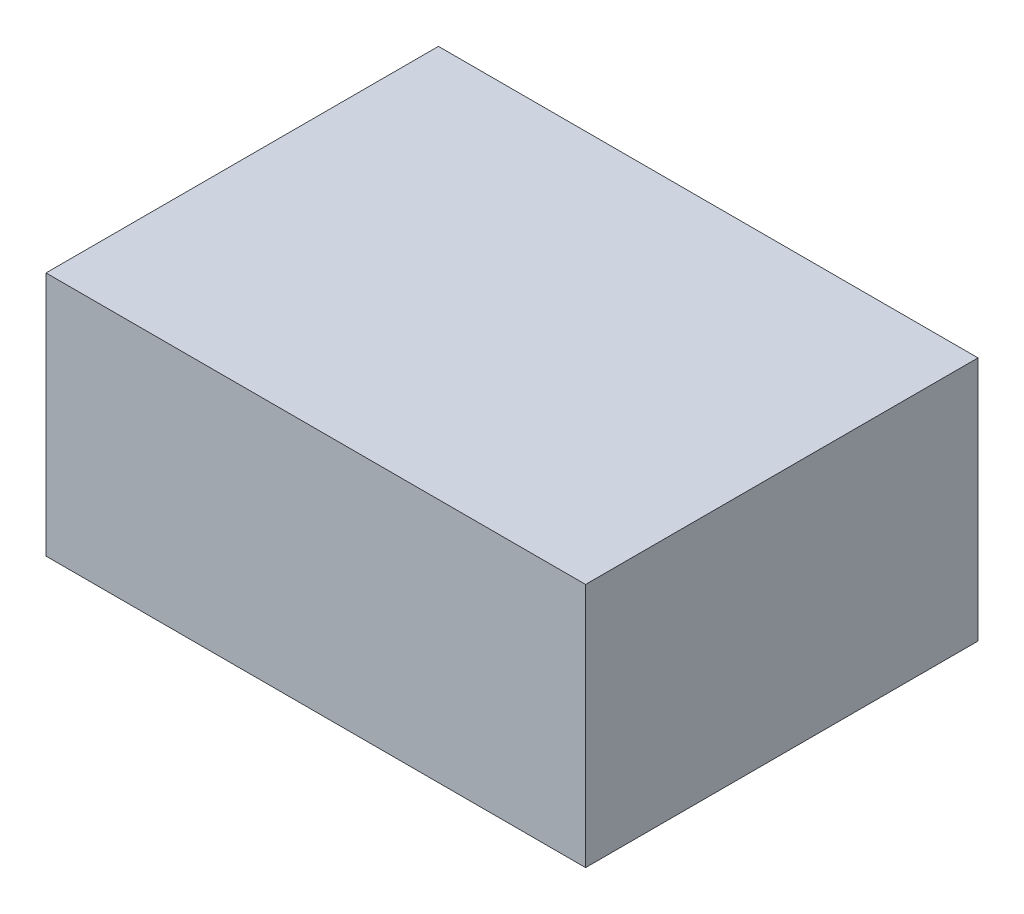
ISO-10303-21;
HEADER;
FILE_DESCRIPTION(('STEP AP214'),'2;1');
FILE_NAME('part.step','',(''),(''),'','','');
FILE_SCHEMA(('AUTOMOTIVE_DESIGN { 1 0 10303 214 1 1 1 1 }'));
ENDSEC;
DATA;
#1=APPLICATION_CONTEXT('core data for automotive mechanical design processes');
#2=APPLICATION_PROTOCOL_DEFINITION('international standard','automotive_design',2000,#1);
#3=PRODUCT_CONTEXT('',#1,'mechanical');
#4=PRODUCT('Part','Part','',(#3));
#5=PRODUCT_RELATED_PRODUCT_CATEGORY('part','',(#4));
#6=PRODUCT_DEFINITION_FORMATION('','',#4);
#7=PRODUCT_DEFINITION_CONTEXT('part definition',#1,'design');
#8=PRODUCT_DEFINITION('design','',#6,#7);
#9=PRODUCT_DEFINITION_SHAPE('','',#8);
#10=(LENGTH_UNIT() NAMED_UNIT(*) SI_UNIT(.MILLI.,.METRE.));
#11=(NAMED_UNIT(*) PLANE_ANGLE_UNIT() SI_UNIT($,.RADIAN.));
#12=(NAMED_UNIT(*) SI_UNIT($,.STERADIAN.) SOLID_ANGLE_UNIT());
#13=UNCERTAINTY_MEASURE_WITH_UNIT(LENGTH_MEASURE(1.E-05),#10,'distance_accuracy_value','');
#14=(GEOMETRIC_REPRESENTATION_CONTEXT(3) GLOBAL_UNCERTAINTY_ASSIGNED_CONTEXT((#13)) GLOBAL_UNIT_ASSIGNED_CONTEXT((#10,
#11,#12)) REPRESENTATION_CONTEXT('',''));
#15=CARTESIAN_POINT('',(0.,0.,0.));
#16=DIRECTION('',(0.,0.,1.));
#17=DIRECTION('',(1.,0.,0.));
#18=AXIS2_PLACEMENT_3D('',#15,#16,#17);
#19=CARTESIAN_POINT('',(0.27500072,-0.12499848,0.));
#20=DIRECTION('',(0.,-1.,0.));
#21=DIRECTION('',(-1.,0.,0.));
#22=AXIS2_PLACEMENT_3D('',#19,#20,#21);
#23=PLANE('',#22);
#24=DIRECTION('',(0.,0.,1.));
#25=VECTOR('',#24,1.);
#26=CARTESIAN_POINT('',(0.27500072,-0.12499848,0.));
#27=LINE('',#26,#25);
#28=CARTESIAN_POINT('',(0.27500072,-0.12499848,0.));
#29=VERTEX_POINT('',#28);
#30=CARTESIAN_POINT('',(0.27500072,-0.12499848,0.3999992));
#31=VERTEX_POINT('',#30);
#32=EDGE_CURVE('E11',#29,#31,#27,.T.);
#33=ORIENTED_EDGE('',*,*,#32,.T.);
#34=DIRECTION('',(-1.,0.,0.));
#35=VECTOR('',#34,1.);
#36=CARTESIAN_POINT('',(0.27500072,-0.12499848,0.3999992));
#37=LINE('',#36,#35);
#38=CARTESIAN_POINT('',(-0.27499818,-0.12499848,0.3999992));
#39=VERTEX_POINT('',#38);
#40=EDGE_CURVE('E24',#31,#39,#37,.T.);
#41=ORIENTED_EDGE('',*,*,#40,.T.);
#42=DIRECTION('',(0.,0.,1.));
#43=VECTOR('',#42,1.);
#44=CARTESIAN_POINT('',(-0.27499818,-0.12499848,0.));
#45=LINE('',#44,#43);
#46=CARTESIAN_POINT('',(-0.27499818,-0.12499848,0.));
#47=VERTEX_POINT('',#46);
#48=EDGE_CURVE('E85',#47,#39,#45,.T.);
#49=ORIENTED_EDGE('',*,*,#48,.F.);
#50=DIRECTION('',(-1.,0.,0.));
#51=VECTOR('',#50,1.);
#52=CARTESIAN_POINT('',(0.27500072,-0.12499848,0.));
#53=LINE('',#52,#51);
#54=EDGE_CURVE('E83',#29,#47,#53,.T.);
#55=ORIENTED_EDGE('',*,*,#54,.F.);
#56=EDGE_LOOP('',(#33,#41,#49,#55));
#57=FACE_BOUND('',#56,.T.);
#58=ADVANCED_FACE('F17',(#57),#23,.T.);
#59=CARTESIAN_POINT('',(-0.27499818,-0.12499848,0.));
#60=DIRECTION('',(-1.,0.,0.));
#61=DIRECTION('',(0.,1.,0.));
#62=AXIS2_PLACEMENT_3D('',#59,#60,#61);
#63=PLANE('',#62);
#64=ORIENTED_EDGE('',*,*,#48,.T.);
#65=DIRECTION('',(0.,1.,0.));
#66=VECTOR('',#65,1.);
#67=CARTESIAN_POINT('',(-0.27499818,-0.12499848,0.3999992));
#68=LINE('',#67,#66);
#69=CARTESIAN_POINT('',(-0.27499818,0.12500102,0.3999992));
#70=VERTEX_POINT('',#69);
#71=EDGE_CURVE('E81',#39,#70,#68,.T.);
#72=ORIENTED_EDGE('',*,*,#71,.T.);
#73=DIRECTION('',(0.,0.,1.));
#74=VECTOR('',#73,1.);
#75=CARTESIAN_POINT('',(-0.27499818,0.12500102,0.));
#76=LINE('',#75,#74);
#77=CARTESIAN_POINT('',(-0.27499818,0.12500102,0.));
#78=VERTEX_POINT('',#77);
#79=EDGE_CURVE('E79',#78,#70,#76,.T.);
#80=ORIENTED_EDGE('',*,*,#79,.F.);
#81=DIRECTION('',(0.,1.,0.));
#82=VECTOR('',#81,1.);
#83=CARTESIAN_POINT('',(-0.27499818,-0.12499848,0.));
#84=LINE('',#83,#82);
#85=EDGE_CURVE('E70',#47,#78,#84,.T.);
#86=ORIENTED_EDGE('',*,*,#85,.F.);
#87=EDGE_LOOP('',(#64,#72,#80,#86));
#88=FACE_BOUND('',#87,.T.);
#89=ADVANCED_FACE('F90',(#88),#63,.T.);
#90=CARTESIAN_POINT('',(-0.27499818,0.12500102,0.));
#91=DIRECTION('',(0.,1.,0.));
#92=DIRECTION('',(1.,0.,0.));
#93=AXIS2_PLACEMENT_3D('',#90,#91,#92);
#94=PLANE('',#93);
#95=ORIENTED_EDGE('',*,*,#79,.T.);
#96=DIRECTION('',(1.,0.,0.));
#97=VECTOR('',#96,1.);
#98=CARTESIAN_POINT('',(-0.27499818,0.12500102,0.3999992));
#99=LINE('',#98,#97);
#100=CARTESIAN_POINT('',(0.27500072,0.12500102,0.3999992));
#101=VERTEX_POINT('',#100);
#102=EDGE_CURVE('E60',#70,#101,#99,.T.);
#103=ORIENTED_EDGE('',*,*,#102,.T.);
#104=DIRECTION('',(0.,0.,1.));
#105=VECTOR('',#104,1.);
#106=CARTESIAN_POINT('',(0.27500072,0.12500102,0.));
#107=LINE('',#106,#105);
#108=CARTESIAN_POINT('',(0.27500072,0.12500102,0.));
#109=VERTEX_POINT('',#108);
#110=EDGE_CURVE('E54',#109,#101,#107,.T.);
#111=ORIENTED_EDGE('',*,*,#110,.F.);
#112=DIRECTION('',(1.,0.,0.));
#113=VECTOR('',#112,1.);
#114=CARTESIAN_POINT('',(-0.27499818,0.12500102,0.));
#115=LINE('',#114,#113);
#116=EDGE_CURVE('E58',#78,#109,#115,.T.);
#117=ORIENTED_EDGE('',*,*,#116,.F.);
#118=EDGE_LOOP('',(#95,#103,#111,#117));
#119=FACE_BOUND('',#118,.T.);
#120=ADVANCED_FACE('F57',(#119),#94,.T.);
#121=CARTESIAN_POINT('',(0.27500072,0.12500102,0.));
#122=DIRECTION('',(1.,0.,0.));
#123=DIRECTION('',(0.,-1.,0.));
#124=AXIS2_PLACEMENT_3D('',#121,#122,#123);
#125=PLANE('',#124);
#126=ORIENTED_EDGE('',*,*,#110,.T.);
#127=DIRECTION('',(0.,-1.,0.));
#128=VECTOR('',#127,1.);
#129=CARTESIAN_POINT('',(0.27500072,0.12500102,0.3999992));
#130=LINE('',#129,#128);
#131=EDGE_CURVE('E71',#101,#31,#130,.T.);
#132=ORIENTED_EDGE('',*,*,#131,.T.);
#133=ORIENTED_EDGE('',*,*,#32,.F.);
#134=DIRECTION('',(0.,-1.,0.));
#135=VECTOR('',#134,1.);
#136=CARTESIAN_POINT('',(0.27500072,0.12500102,0.));
#137=LINE('',#136,#135);
#138=EDGE_CURVE('E68',#109,#29,#137,.T.);
#139=ORIENTED_EDGE('',*,*,#138,.F.);
#140=EDGE_LOOP('',(#126,#132,#133,#139));
#141=FACE_BOUND('',#140,.T.);
#142=ADVANCED_FACE('F73',(#141),#125,.T.);
#143=CARTESIAN_POINT('',(1.270000000277E-06,1.269999998494E-06,0.));
#144=DIRECTION('',(0.,0.,-1.));
#145=DIRECTION('',(-1.,0.,0.));
#146=AXIS2_PLACEMENT_3D('',#143,#144,#145);
#147=PLANE('',#146);
#148=ORIENTED_EDGE('',*,*,#54,.T.);
#149=ORIENTED_EDGE('',*,*,#85,.T.);
#150=ORIENTED_EDGE('',*,*,#116,.T.);
#151=ORIENTED_EDGE('',*,*,#138,.T.);
#152=EDGE_LOOP('',(#148,#149,#150,#151));
#153=FACE_BOUND('',#152,.T.);
#154=ADVANCED_FACE('F67',(#153),#147,.T.);
#155=CARTESIAN_POINT('',(1.270000000277E-06,1.269999998494E-06,0.3999992));
#156=DIRECTION('',(0.,0.,-1.));
#157=DIRECTION('',(-1.,0.,0.));
#158=AXIS2_PLACEMENT_3D('',#155,#156,#157);
#159=PLANE('',#158);
#160=ORIENTED_EDGE('',*,*,#131,.F.);
#161=ORIENTED_EDGE('',*,*,#102,.F.);
#162=ORIENTED_EDGE('',*,*,#71,.F.);
#163=ORIENTED_EDGE('',*,*,#40,.F.);
#164=EDGE_LOOP('',(#160,#161,#162,#163));
#165=FACE_BOUND('',#164,.T.);
#166=ADVANCED_FACE('F91',(#165),#159,.F.);
#167=CLOSED_SHELL('',(#58,#89,#120,#142,#154,#166));
#168=MANIFOLD_SOLID_BREP('B1',#167);
#169=ADVANCED_BREP_SHAPE_REPRESENTATION('',(#18,#168),#14);
#170=SHAPE_DEFINITION_REPRESENTATION(#9,#169);
ENDSEC;
END-ISO-10303-21;
